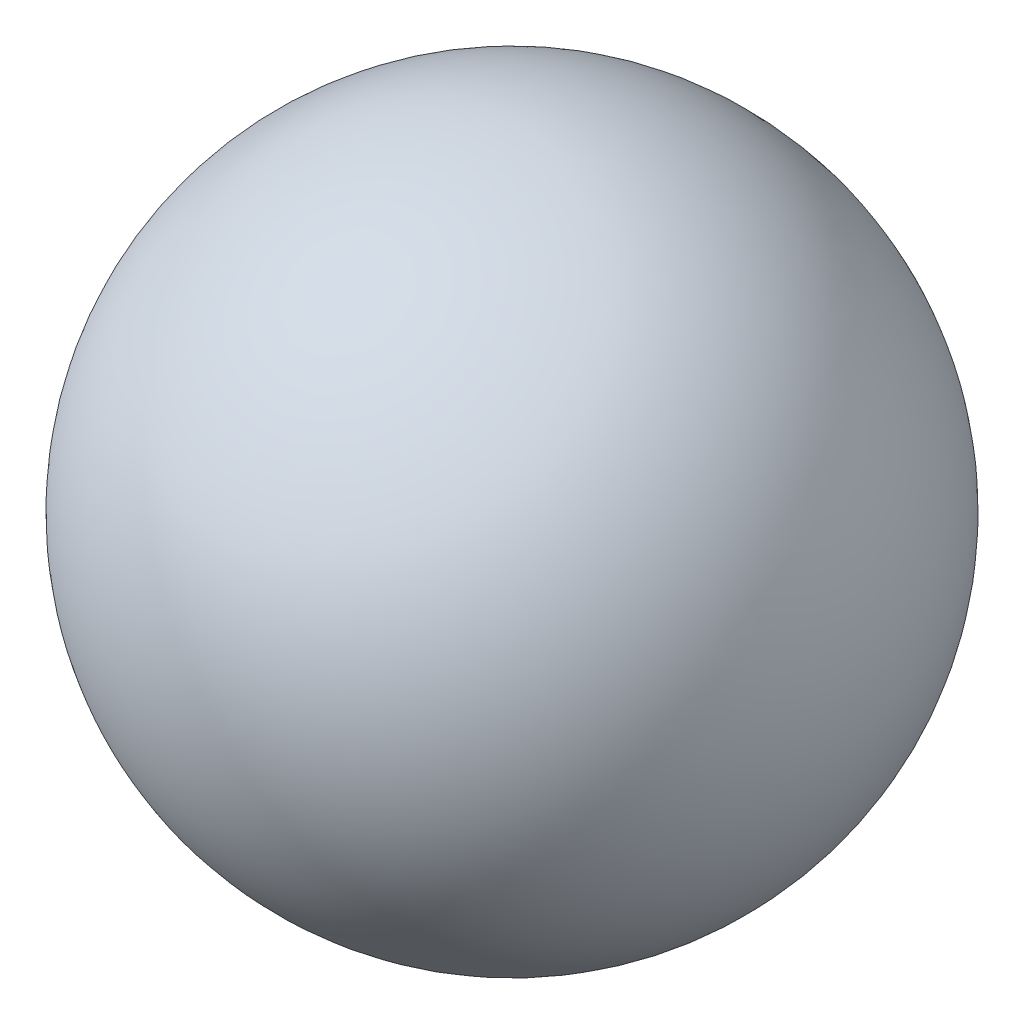
ISO-10303-21;
HEADER;
FILE_DESCRIPTION(('STEP AP214'),'2;1');
FILE_NAME('part.step','',(''),(''),'','','');
FILE_SCHEMA(('AUTOMOTIVE_DESIGN { 1 0 10303 214 1 1 1 1 }'));
ENDSEC;
DATA;
#1=APPLICATION_CONTEXT('core data for automotive mechanical design processes');
#2=APPLICATION_PROTOCOL_DEFINITION('international standard','automotive_design',2000,#1);
#3=PRODUCT_CONTEXT('',#1,'mechanical');
#4=PRODUCT('Part','Part','',(#3));
#5=PRODUCT_RELATED_PRODUCT_CATEGORY('part','',(#4));
#6=PRODUCT_DEFINITION_FORMATION('','',#4);
#7=PRODUCT_DEFINITION_CONTEXT('part definition',#1,'design');
#8=PRODUCT_DEFINITION('design','',#6,#7);
#9=PRODUCT_DEFINITION_SHAPE('','',#8);
#10=(LENGTH_UNIT() NAMED_UNIT(*) SI_UNIT(.MILLI.,.METRE.));
#11=(NAMED_UNIT(*) PLANE_ANGLE_UNIT() SI_UNIT($,.RADIAN.));
#12=(NAMED_UNIT(*) SI_UNIT($,.STERADIAN.) SOLID_ANGLE_UNIT());
#13=UNCERTAINTY_MEASURE_WITH_UNIT(LENGTH_MEASURE(1.E-05),#10,'distance_accuracy_value','');
#14=(GEOMETRIC_REPRESENTATION_CONTEXT(3) GLOBAL_UNCERTAINTY_ASSIGNED_CONTEXT((#13)) GLOBAL_UNIT_ASSIGNED_CONTEXT((#10,
#11,#12)) REPRESENTATION_CONTEXT('',''));
#15=CARTESIAN_POINT('',(0.,0.,0.));
#16=DIRECTION('',(0.,0.,1.));
#17=DIRECTION('',(1.,0.,0.));
#18=AXIS2_PLACEMENT_3D('',#15,#16,#17);
#19=CARTESIAN_POINT('',(57.535,0.536956819018196,-61.5291570690231));
#20=DIRECTION('',(0.,0.00872653549837389,-0.999961923064171));
#21=DIRECTION('',(0.173648177666934,0.984770254550592,0.00859395981573486));
#22=AXIS2_PLACEMENT_3D('',#19,#20,#21);
#23=SPHERICAL_SURFACE('',#22,6.75);
#24=CARTESIAN_POINT('',(57.535,0.595860933632218,-68.2789000497063));
#25=VERTEX_POINT('',#24);
#26=VERTEX_LOOP('',#25);
#27=FACE_BOUND('',#26,.T.);
#28=CARTESIAN_POINT('',(57.535,0.478052704404172,-54.7794140883399));
#29=VERTEX_POINT('',#28);
#30=VERTEX_LOOP('',#29);
#31=FACE_BOUND('',#30,.T.);
#32=ADVANCED_FACE('F16',(#27,#31),#23,.T.);
#33=CLOSED_SHELL('',(#32));
#34=MANIFOLD_SOLID_BREP('B1',#33);
#35=ADVANCED_BREP_SHAPE_REPRESENTATION('',(#18,#34),#14);
#36=SHAPE_DEFINITION_REPRESENTATION(#9,#35);
ENDSEC;
END-ISO-10303-21;
